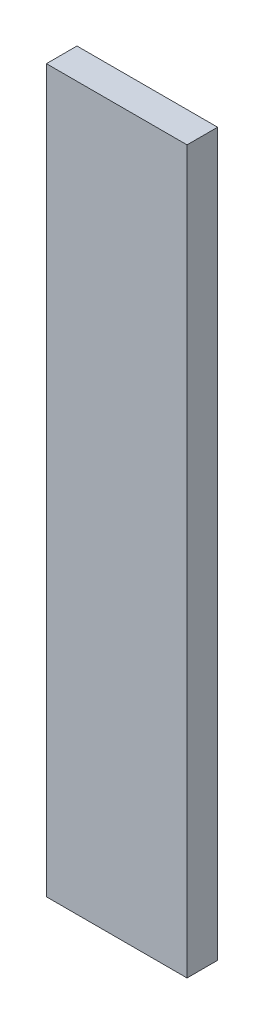
ISO-10303-21;
HEADER;
FILE_DESCRIPTION(('STEP AP214'),'2;1');
FILE_NAME('part.step','',(''),(''),'','','');
FILE_SCHEMA(('AUTOMOTIVE_DESIGN { 1 0 10303 214 1 1 1 1 }'));
ENDSEC;
DATA;
#1=APPLICATION_CONTEXT('core data for automotive mechanical design processes');
#2=APPLICATION_PROTOCOL_DEFINITION('international standard','automotive_design',2000,#1);
#3=PRODUCT_CONTEXT('',#1,'mechanical');
#4=PRODUCT('Part','Part','',(#3));
#5=PRODUCT_RELATED_PRODUCT_CATEGORY('part','',(#4));
#6=PRODUCT_DEFINITION_FORMATION('','',#4);
#7=PRODUCT_DEFINITION_CONTEXT('part definition',#1,'design');
#8=PRODUCT_DEFINITION('design','',#6,#7);
#9=PRODUCT_DEFINITION_SHAPE('','',#8);
#10=(LENGTH_UNIT() NAMED_UNIT(*) SI_UNIT(.MILLI.,.METRE.));
#11=(NAMED_UNIT(*) PLANE_ANGLE_UNIT() SI_UNIT($,.RADIAN.));
#12=(NAMED_UNIT(*) SI_UNIT($,.STERADIAN.) SOLID_ANGLE_UNIT());
#13=UNCERTAINTY_MEASURE_WITH_UNIT(LENGTH_MEASURE(1.E-05),#10,'distance_accuracy_value','');
#14=(GEOMETRIC_REPRESENTATION_CONTEXT(3) GLOBAL_UNCERTAINTY_ASSIGNED_CONTEXT((#13)) GLOBAL_UNIT_ASSIGNED_CONTEXT((#10,
#11,#12)) REPRESENTATION_CONTEXT('',''));
#15=CARTESIAN_POINT('',(0.,0.,0.));
#16=DIRECTION('',(0.,0.,1.));
#17=DIRECTION('',(1.,0.,0.));
#18=AXIS2_PLACEMENT_3D('',#15,#16,#17);
#19=CARTESIAN_POINT('',(46.,-190.,10.));
#20=DIRECTION('',(-1.,0.,0.));
#21=DIRECTION('',(0.,0.,1.));
#22=AXIS2_PLACEMENT_3D('',#19,#20,#21);
#23=PLANE('',#22);
#24=DIRECTION('',(0.,1.,0.));
#25=VECTOR('',#24,1.);
#26=CARTESIAN_POINT('',(46.,-190.,0.));
#27=LINE('',#26,#25);
#28=CARTESIAN_POINT('',(46.,-190.,0.));
#29=VERTEX_POINT('',#28);
#30=CARTESIAN_POINT('',(46.,46.,0.));
#31=VERTEX_POINT('',#30);
#32=EDGE_CURVE('E96',#29,#31,#27,.T.);
#33=ORIENTED_EDGE('',*,*,#32,.T.);
#34=DIRECTION('',(0.,0.,-1.));
#35=VECTOR('',#34,1.);
#36=CARTESIAN_POINT('',(46.,46.,10.));
#37=LINE('',#36,#35);
#38=CARTESIAN_POINT('',(46.,46.,10.));
#39=VERTEX_POINT('',#38);
#40=EDGE_CURVE('E11',#39,#31,#37,.T.);
#41=ORIENTED_EDGE('',*,*,#40,.F.);
#42=DIRECTION('',(0.,1.,0.));
#43=VECTOR('',#42,1.);
#44=CARTESIAN_POINT('',(46.,-190.,10.));
#45=LINE('',#44,#43);
#46=CARTESIAN_POINT('',(46.,-190.,10.));
#47=VERTEX_POINT('',#46);
#48=EDGE_CURVE('E84',#47,#39,#45,.T.);
#49=ORIENTED_EDGE('',*,*,#48,.F.);
#50=DIRECTION('',(0.,0.,-1.));
#51=VECTOR('',#50,1.);
#52=CARTESIAN_POINT('',(46.,-190.,10.));
#53=LINE('',#52,#51);
#54=EDGE_CURVE('E92',#47,#29,#53,.T.);
#55=ORIENTED_EDGE('',*,*,#54,.T.);
#56=EDGE_LOOP('',(#33,#41,#49,#55));
#57=FACE_BOUND('',#56,.T.);
#58=ADVANCED_FACE('F33',(#57),#23,.F.);
#59=CARTESIAN_POINT('',(0.,46.,10.));
#60=DIRECTION('',(0.,-1.,0.));
#61=DIRECTION('',(1.,0.,0.));
#62=AXIS2_PLACEMENT_3D('',#59,#60,#61);
#63=PLANE('',#62);
#64=DIRECTION('',(-1.,0.,0.));
#65=VECTOR('',#64,1.);
#66=CARTESIAN_POINT('',(0.,46.,0.));
#67=LINE('',#66,#65);
#68=CARTESIAN_POINT('',(0.,46.,0.));
#69=VERTEX_POINT('',#68);
#70=EDGE_CURVE('E88',#31,#69,#67,.T.);
#71=ORIENTED_EDGE('',*,*,#70,.T.);
#72=DIRECTION('',(0.,0.,-1.));
#73=VECTOR('',#72,1.);
#74=CARTESIAN_POINT('',(0.,46.,10.));
#75=LINE('',#74,#73);
#76=CARTESIAN_POINT('',(0.,46.,10.));
#77=VERTEX_POINT('',#76);
#78=EDGE_CURVE('E41',#77,#69,#75,.T.);
#79=ORIENTED_EDGE('',*,*,#78,.F.);
#80=DIRECTION('',(-1.,0.,0.));
#81=VECTOR('',#80,1.);
#82=CARTESIAN_POINT('',(0.,46.,10.));
#83=LINE('',#82,#81);
#84=EDGE_CURVE('E79',#39,#77,#83,.T.);
#85=ORIENTED_EDGE('',*,*,#84,.F.);
#86=ORIENTED_EDGE('',*,*,#40,.T.);
#87=EDGE_LOOP('',(#71,#79,#85,#86));
#88=FACE_BOUND('',#87,.T.);
#89=ADVANCED_FACE('F87',(#88),#63,.F.);
#90=CARTESIAN_POINT('',(0.,46.,10.));
#91=DIRECTION('',(1.,0.,0.));
#92=DIRECTION('',(0.,0.,-1.));
#93=AXIS2_PLACEMENT_3D('',#90,#91,#92);
#94=PLANE('',#93);
#95=DIRECTION('',(0.,-1.,0.));
#96=VECTOR('',#95,1.);
#97=CARTESIAN_POINT('',(0.,46.,0.));
#98=LINE('',#97,#96);
#99=CARTESIAN_POINT('',(0.,-190.,0.));
#100=VERTEX_POINT('',#99);
#101=EDGE_CURVE('E66',#69,#100,#98,.T.);
#102=ORIENTED_EDGE('',*,*,#101,.T.);
#103=DIRECTION('',(0.,0.,-1.));
#104=VECTOR('',#103,1.);
#105=CARTESIAN_POINT('',(0.,-190.,10.));
#106=LINE('',#105,#104);
#107=CARTESIAN_POINT('',(0.,-190.,10.));
#108=VERTEX_POINT('',#107);
#109=EDGE_CURVE('E89',#108,#100,#106,.T.);
#110=ORIENTED_EDGE('',*,*,#109,.F.);
#111=DIRECTION('',(0.,-1.,0.));
#112=VECTOR('',#111,1.);
#113=CARTESIAN_POINT('',(0.,46.,10.));
#114=LINE('',#113,#112);
#115=EDGE_CURVE('E82',#77,#108,#114,.T.);
#116=ORIENTED_EDGE('',*,*,#115,.F.);
#117=ORIENTED_EDGE('',*,*,#78,.T.);
#118=EDGE_LOOP('',(#102,#110,#116,#117));
#119=FACE_BOUND('',#118,.T.);
#120=ADVANCED_FACE('F90',(#119),#94,.F.);
#121=CARTESIAN_POINT('',(0.,-190.,10.));
#122=DIRECTION('',(0.,1.,0.));
#123=DIRECTION('',(0.,0.,1.));
#124=AXIS2_PLACEMENT_3D('',#121,#122,#123);
#125=PLANE('',#124);
#126=DIRECTION('',(1.,0.,0.));
#127=VECTOR('',#126,1.);
#128=CARTESIAN_POINT('',(0.,-190.,0.));
#129=LINE('',#128,#127);
#130=EDGE_CURVE('E72',#100,#29,#129,.T.);
#131=ORIENTED_EDGE('',*,*,#130,.T.);
#132=ORIENTED_EDGE('',*,*,#54,.F.);
#133=DIRECTION('',(1.,0.,0.));
#134=VECTOR('',#133,1.);
#135=CARTESIAN_POINT('',(0.,-190.,10.));
#136=LINE('',#135,#134);
#137=EDGE_CURVE('E49',#108,#47,#136,.T.);
#138=ORIENTED_EDGE('',*,*,#137,.F.);
#139=ORIENTED_EDGE('',*,*,#109,.T.);
#140=EDGE_LOOP('',(#131,#132,#138,#139));
#141=FACE_BOUND('',#140,.T.);
#142=ADVANCED_FACE('F103',(#141),#125,.F.);
#143=CARTESIAN_POINT('',(0.,0.,10.));
#144=DIRECTION('',(0.,0.,-1.));
#145=DIRECTION('',(-1.,0.,0.));
#146=AXIS2_PLACEMENT_3D('',#143,#144,#145);
#147=PLANE('',#146);
#148=ORIENTED_EDGE('',*,*,#48,.T.);
#149=ORIENTED_EDGE('',*,*,#84,.T.);
#150=ORIENTED_EDGE('',*,*,#115,.T.);
#151=ORIENTED_EDGE('',*,*,#137,.T.);
#152=EDGE_LOOP('',(#148,#149,#150,#151));
#153=FACE_BOUND('',#152,.T.);
#154=ADVANCED_FACE('F80',(#153),#147,.F.);
#155=CARTESIAN_POINT('',(0.,0.,0.));
#156=DIRECTION('',(0.,0.,-1.));
#157=DIRECTION('',(-1.,0.,0.));
#158=AXIS2_PLACEMENT_3D('',#155,#156,#157);
#159=PLANE('',#158);
#160=ORIENTED_EDGE('',*,*,#32,.F.);
#161=ORIENTED_EDGE('',*,*,#130,.F.);
#162=ORIENTED_EDGE('',*,*,#101,.F.);
#163=ORIENTED_EDGE('',*,*,#70,.F.);
#164=EDGE_LOOP('',(#160,#161,#162,#163));
#165=FACE_BOUND('',#164,.T.);
#166=ADVANCED_FACE('F106',(#165),#159,.T.);
#167=CLOSED_SHELL('',(#58,#89,#120,#142,#154,#166));
#168=MANIFOLD_SOLID_BREP('B2',#167);
#169=ADVANCED_BREP_SHAPE_REPRESENTATION('',(#18,#168),#14);
#170=SHAPE_DEFINITION_REPRESENTATION(#9,#169);
ENDSEC;
END-ISO-10303-21;
